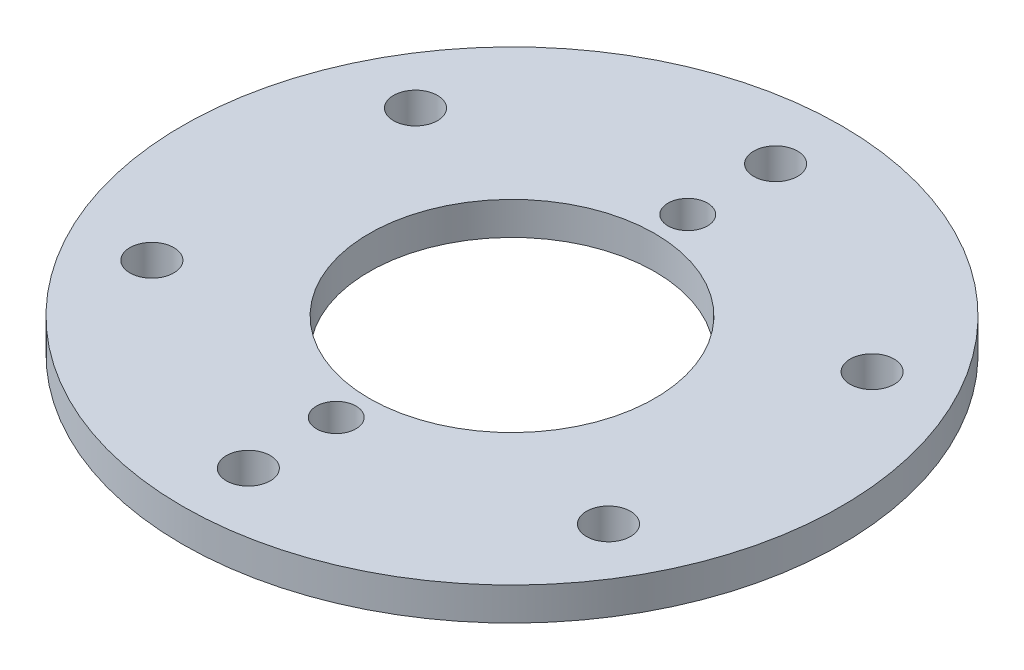
ISO-10303-21;
HEADER;
FILE_DESCRIPTION(('STEP AP214'),'2;1');
FILE_NAME('part.step','',(''),(''),'','','');
FILE_SCHEMA(('AUTOMOTIVE_DESIGN { 1 0 10303 214 1 1 1 1 }'));
ENDSEC;
DATA;
#1=APPLICATION_CONTEXT('core data for automotive mechanical design processes');
#2=APPLICATION_PROTOCOL_DEFINITION('international standard','automotive_design',2000,#1);
#3=PRODUCT_CONTEXT('',#1,'mechanical');
#4=PRODUCT('Part','Part','',(#3));
#5=PRODUCT_RELATED_PRODUCT_CATEGORY('part','',(#4));
#6=PRODUCT_DEFINITION_FORMATION('','',#4);
#7=PRODUCT_DEFINITION_CONTEXT('part definition',#1,'design');
#8=PRODUCT_DEFINITION('design','',#6,#7);
#9=PRODUCT_DEFINITION_SHAPE('','',#8);
#10=(LENGTH_UNIT() NAMED_UNIT(*) SI_UNIT(.MILLI.,.METRE.));
#11=(NAMED_UNIT(*) PLANE_ANGLE_UNIT() SI_UNIT($,.RADIAN.));
#12=(NAMED_UNIT(*) SI_UNIT($,.STERADIAN.) SOLID_ANGLE_UNIT());
#13=UNCERTAINTY_MEASURE_WITH_UNIT(LENGTH_MEASURE(1.E-05),#10,'distance_accuracy_value','');
#14=(GEOMETRIC_REPRESENTATION_CONTEXT(3) GLOBAL_UNCERTAINTY_ASSIGNED_CONTEXT((#13)) GLOBAL_UNIT_ASSIGNED_CONTEXT((#10,
#11,#12)) REPRESENTATION_CONTEXT('',''));
#15=CARTESIAN_POINT('',(0.,0.,0.));
#16=DIRECTION('',(0.,0.,1.));
#17=DIRECTION('',(1.,0.,0.));
#18=AXIS2_PLACEMENT_3D('',#15,#16,#17);
#19=CARTESIAN_POINT('',(0.,15.,0.));
#20=DIRECTION('',(0.,1.,0.));
#21=DIRECTION('',(0.,0.,1.));
#22=AXIS2_PLACEMENT_3D('',#19,#20,#21);
#23=PLANE('',#22);
#24=CARTESIAN_POINT('',(0.,15.,80.));
#25=DIRECTION('',(0.,1.,0.));
#26=DIRECTION('',(0.,0.,1.));
#27=AXIS2_PLACEMENT_3D('',#24,#25,#26);
#28=CIRCLE('',#27,9.);
#29=CARTESIAN_POINT('',(0.,15.,89.));
#30=VERTEX_POINT('',#29);
#31=EDGE_CURVE('E125',#30,#30,#28,.T.);
#32=ORIENTED_EDGE('',*,*,#31,.F.);
#33=EDGE_LOOP('',(#32));
#34=FACE_BOUND('',#33,.T.);
#35=CARTESIAN_POINT('',(0.,15.,-80.));
#36=DIRECTION('',(0.,1.,0.));
#37=DIRECTION('',(0.,0.,1.));
#38=AXIS2_PLACEMENT_3D('',#35,#36,#37);
#39=CIRCLE('',#38,9.);
#40=CARTESIAN_POINT('',(0.,15.,-71.));
#41=VERTEX_POINT('',#40);
#42=EDGE_CURVE('E117',#41,#41,#39,.T.);
#43=ORIENTED_EDGE('',*,*,#42,.F.);
#44=EDGE_LOOP('',(#43));
#45=FACE_BOUND('',#44,.T.);
#46=CARTESIAN_POINT('',(103.923048454132,15.,-60.0000000000012));
#47=DIRECTION('',(0.,1.,0.));
#48=DIRECTION('',(0.,0.,1.));
#49=AXIS2_PLACEMENT_3D('',#46,#47,#48);
#50=CIRCLE('',#49,9.99999999999999);
#51=CARTESIAN_POINT('',(103.923048454132,15.,-50.0000000000012));
#52=VERTEX_POINT('',#51);
#53=EDGE_CURVE('E109',#52,#52,#50,.T.);
#54=ORIENTED_EDGE('',*,*,#53,.F.);
#55=EDGE_LOOP('',(#54));
#56=FACE_BOUND('',#55,.T.);
#57=CARTESIAN_POINT('',(103.923048454133,15.,59.999999999999));
#58=DIRECTION('',(0.,1.,0.));
#59=DIRECTION('',(0.,0.,1.));
#60=AXIS2_PLACEMENT_3D('',#57,#58,#59);
#61=CIRCLE('',#60,9.99999999999999);
#62=CARTESIAN_POINT('',(103.923048454133,15.,69.999999999999));
#63=VERTEX_POINT('',#62);
#64=EDGE_CURVE('E101',#63,#63,#61,.T.);
#65=ORIENTED_EDGE('',*,*,#64,.F.);
#66=EDGE_LOOP('',(#65));
#67=FACE_BOUND('',#66,.T.);
#68=CARTESIAN_POINT('',(0.,15.,120.));
#69=DIRECTION('',(0.,1.,0.));
#70=DIRECTION('',(0.,0.,1.));
#71=AXIS2_PLACEMENT_3D('',#68,#69,#70);
#72=CIRCLE('',#71,10.);
#73=CARTESIAN_POINT('',(0.,15.,130.));
#74=VERTEX_POINT('',#73);
#75=EDGE_CURVE('E93',#74,#74,#72,.T.);
#76=ORIENTED_EDGE('',*,*,#75,.F.);
#77=EDGE_LOOP('',(#76));
#78=FACE_BOUND('',#77,.T.);
#79=CARTESIAN_POINT('',(-103.923048454132,15.,60.0000000000005));
#80=DIRECTION('',(0.,1.,0.));
#81=DIRECTION('',(0.,0.,1.));
#82=AXIS2_PLACEMENT_3D('',#79,#80,#81);
#83=CIRCLE('',#82,9.99999999999999);
#84=CARTESIAN_POINT('',(-103.923048454132,15.,70.0000000000005));
#85=VERTEX_POINT('',#84);
#86=EDGE_CURVE('E85',#85,#85,#83,.T.);
#87=ORIENTED_EDGE('',*,*,#86,.F.);
#88=EDGE_LOOP('',(#87));
#89=FACE_BOUND('',#88,.T.);
#90=CARTESIAN_POINT('',(-103.923048454133,15.,-59.9999999999998));
#91=DIRECTION('',(0.,1.,0.));
#92=DIRECTION('',(0.,0.,1.));
#93=AXIS2_PLACEMENT_3D('',#90,#91,#92);
#94=CIRCLE('',#93,9.99999999999999);
#95=CARTESIAN_POINT('',(-103.923048454133,15.,-49.9999999999998));
#96=VERTEX_POINT('',#95);
#97=EDGE_CURVE('E77',#96,#96,#94,.T.);
#98=ORIENTED_EDGE('',*,*,#97,.F.);
#99=EDGE_LOOP('',(#98));
#100=FACE_BOUND('',#99,.T.);
#101=CARTESIAN_POINT('',(0.,15.,-120.));
#102=DIRECTION('',(0.,1.,0.));
#103=DIRECTION('',(0.,0.,1.));
#104=AXIS2_PLACEMENT_3D('',#101,#102,#103);
#105=CIRCLE('',#104,10.);
#106=CARTESIAN_POINT('',(0.,15.,-110.));
#107=VERTEX_POINT('',#106);
#108=EDGE_CURVE('E69',#107,#107,#105,.T.);
#109=ORIENTED_EDGE('',*,*,#108,.F.);
#110=EDGE_LOOP('',(#109));
#111=FACE_BOUND('',#110,.T.);
#112=CARTESIAN_POINT('',(0.,15.,0.));
#113=DIRECTION('',(0.,1.,0.));
#114=DIRECTION('',(0.,0.,1.));
#115=AXIS2_PLACEMENT_3D('',#112,#113,#114);
#116=CIRCLE('',#115,150.);
#117=CARTESIAN_POINT('',(0.,15.,150.));
#118=VERTEX_POINT('',#117);
#119=EDGE_CURVE('E10',#118,#118,#116,.T.);
#120=ORIENTED_EDGE('',*,*,#119,.T.);
#121=EDGE_LOOP('',(#120));
#122=FACE_BOUND('',#121,.T.);
#123=CARTESIAN_POINT('',(0.,15.,0.));
#124=DIRECTION('',(0.,1.,0.));
#125=DIRECTION('',(0.,0.,1.));
#126=AXIS2_PLACEMENT_3D('',#123,#124,#125);
#127=CIRCLE('',#126,65.);
#128=CARTESIAN_POINT('',(0.,15.,65.));
#129=VERTEX_POINT('',#128);
#130=EDGE_CURVE('E56',#129,#129,#127,.T.);
#131=ORIENTED_EDGE('',*,*,#130,.F.);
#132=EDGE_LOOP('',(#131));
#133=FACE_BOUND('',#132,.T.);
#134=ADVANCED_FACE('F43',(#34,#45,#56,#67,#78,#89,#100,#111,#122,#133),#23,.T.);
#135=CARTESIAN_POINT('',(0.,0.,0.));
#136=DIRECTION('',(0.,1.,0.));
#137=DIRECTION('',(0.,0.,1.));
#138=AXIS2_PLACEMENT_3D('',#135,#136,#137);
#139=PLANE('',#138);
#140=CARTESIAN_POINT('',(0.,0.,80.));
#141=DIRECTION('',(0.,1.,0.));
#142=DIRECTION('',(0.,0.,1.));
#143=AXIS2_PLACEMENT_3D('',#140,#141,#142);
#144=CIRCLE('',#143,9.);
#145=CARTESIAN_POINT('',(0.,0.,89.));
#146=VERTEX_POINT('',#145);
#147=EDGE_CURVE('E121',#146,#146,#144,.T.);
#148=ORIENTED_EDGE('',*,*,#147,.T.);
#149=EDGE_LOOP('',(#148));
#150=FACE_BOUND('',#149,.T.);
#151=CARTESIAN_POINT('',(0.,0.,-80.));
#152=DIRECTION('',(0.,1.,0.));
#153=DIRECTION('',(0.,0.,1.));
#154=AXIS2_PLACEMENT_3D('',#151,#152,#153);
#155=CIRCLE('',#154,9.);
#156=CARTESIAN_POINT('',(0.,0.,-71.));
#157=VERTEX_POINT('',#156);
#158=EDGE_CURVE('E113',#157,#157,#155,.T.);
#159=ORIENTED_EDGE('',*,*,#158,.T.);
#160=EDGE_LOOP('',(#159));
#161=FACE_BOUND('',#160,.T.);
#162=CARTESIAN_POINT('',(103.923048454132,0.,-60.0000000000012));
#163=DIRECTION('',(0.,1.,0.));
#164=DIRECTION('',(0.,0.,1.));
#165=AXIS2_PLACEMENT_3D('',#162,#163,#164);
#166=CIRCLE('',#165,9.99999999999999);
#167=CARTESIAN_POINT('',(103.923048454132,0.,-50.0000000000012));
#168=VERTEX_POINT('',#167);
#169=EDGE_CURVE('E105',#168,#168,#166,.T.);
#170=ORIENTED_EDGE('',*,*,#169,.T.);
#171=EDGE_LOOP('',(#170));
#172=FACE_BOUND('',#171,.T.);
#173=CARTESIAN_POINT('',(103.923048454133,0.,59.999999999999));
#174=DIRECTION('',(0.,1.,0.));
#175=DIRECTION('',(0.,0.,1.));
#176=AXIS2_PLACEMENT_3D('',#173,#174,#175);
#177=CIRCLE('',#176,9.99999999999999);
#178=CARTESIAN_POINT('',(103.923048454133,0.,69.999999999999));
#179=VERTEX_POINT('',#178);
#180=EDGE_CURVE('E97',#179,#179,#177,.T.);
#181=ORIENTED_EDGE('',*,*,#180,.T.);
#182=EDGE_LOOP('',(#181));
#183=FACE_BOUND('',#182,.T.);
#184=CARTESIAN_POINT('',(0.,0.,120.));
#185=DIRECTION('',(0.,1.,0.));
#186=DIRECTION('',(0.,0.,1.));
#187=AXIS2_PLACEMENT_3D('',#184,#185,#186);
#188=CIRCLE('',#187,10.);
#189=CARTESIAN_POINT('',(0.,0.,130.));
#190=VERTEX_POINT('',#189);
#191=EDGE_CURVE('E89',#190,#190,#188,.T.);
#192=ORIENTED_EDGE('',*,*,#191,.T.);
#193=EDGE_LOOP('',(#192));
#194=FACE_BOUND('',#193,.T.);
#195=CARTESIAN_POINT('',(-103.923048454132,0.,60.0000000000005));
#196=DIRECTION('',(0.,1.,0.));
#197=DIRECTION('',(0.,0.,1.));
#198=AXIS2_PLACEMENT_3D('',#195,#196,#197);
#199=CIRCLE('',#198,9.99999999999999);
#200=CARTESIAN_POINT('',(-103.923048454132,0.,70.0000000000005));
#201=VERTEX_POINT('',#200);
#202=EDGE_CURVE('E81',#201,#201,#199,.T.);
#203=ORIENTED_EDGE('',*,*,#202,.T.);
#204=EDGE_LOOP('',(#203));
#205=FACE_BOUND('',#204,.T.);
#206=CARTESIAN_POINT('',(-103.923048454133,0.,-59.9999999999998));
#207=DIRECTION('',(0.,1.,0.));
#208=DIRECTION('',(0.,0.,1.));
#209=AXIS2_PLACEMENT_3D('',#206,#207,#208);
#210=CIRCLE('',#209,9.99999999999999);
#211=CARTESIAN_POINT('',(-103.923048454133,0.,-49.9999999999998));
#212=VERTEX_POINT('',#211);
#213=EDGE_CURVE('E73',#212,#212,#210,.T.);
#214=ORIENTED_EDGE('',*,*,#213,.T.);
#215=EDGE_LOOP('',(#214));
#216=FACE_BOUND('',#215,.T.);
#217=CARTESIAN_POINT('',(0.,0.,-120.));
#218=DIRECTION('',(0.,1.,0.));
#219=DIRECTION('',(0.,0.,1.));
#220=AXIS2_PLACEMENT_3D('',#217,#218,#219);
#221=CIRCLE('',#220,10.);
#222=CARTESIAN_POINT('',(0.,0.,-110.));
#223=VERTEX_POINT('',#222);
#224=EDGE_CURVE('E62',#223,#223,#221,.T.);
#225=ORIENTED_EDGE('',*,*,#224,.T.);
#226=EDGE_LOOP('',(#225));
#227=FACE_BOUND('',#226,.T.);
#228=CARTESIAN_POINT('',(0.,0.,0.));
#229=DIRECTION('',(0.,1.,0.));
#230=DIRECTION('',(0.,0.,1.));
#231=AXIS2_PLACEMENT_3D('',#228,#229,#230);
#232=CIRCLE('',#231,150.);
#233=CARTESIAN_POINT('',(0.,0.,150.));
#234=VERTEX_POINT('',#233);
#235=EDGE_CURVE('E47',#234,#234,#232,.T.);
#236=ORIENTED_EDGE('',*,*,#235,.F.);
#237=EDGE_LOOP('',(#236));
#238=FACE_BOUND('',#237,.T.);
#239=CARTESIAN_POINT('',(0.,0.,0.));
#240=DIRECTION('',(0.,1.,0.));
#241=DIRECTION('',(0.,0.,1.));
#242=AXIS2_PLACEMENT_3D('',#239,#240,#241);
#243=CIRCLE('',#242,65.);
#244=CARTESIAN_POINT('',(0.,0.,65.));
#245=VERTEX_POINT('',#244);
#246=EDGE_CURVE('E58',#245,#245,#243,.T.);
#247=ORIENTED_EDGE('',*,*,#246,.T.);
#248=EDGE_LOOP('',(#247));
#249=FACE_BOUND('',#248,.T.);
#250=ADVANCED_FACE('F134',(#150,#161,#172,#183,#194,#205,#216,#227,#238,#249),#139,.F.);
#251=CARTESIAN_POINT('',(0.,15.,0.));
#252=DIRECTION('',(0.,-1.,0.));
#253=DIRECTION('',(0.,0.,-1.));
#254=AXIS2_PLACEMENT_3D('',#251,#252,#253);
#255=CYLINDRICAL_SURFACE('',#254,150.);
#256=ORIENTED_EDGE('',*,*,#119,.F.);
#257=EDGE_LOOP('',(#256));
#258=FACE_BOUND('',#257,.T.);
#259=ORIENTED_EDGE('',*,*,#235,.T.);
#260=EDGE_LOOP('',(#259));
#261=FACE_BOUND('',#260,.T.);
#262=ADVANCED_FACE('F45',(#258,#261),#255,.T.);
#263=CARTESIAN_POINT('',(0.,15.,0.));
#264=DIRECTION('',(0.,-1.,0.));
#265=DIRECTION('',(0.,0.,-1.));
#266=AXIS2_PLACEMENT_3D('',#263,#264,#265);
#267=CYLINDRICAL_SURFACE('',#266,65.);
#268=ORIENTED_EDGE('',*,*,#130,.T.);
#269=EDGE_LOOP('',(#268));
#270=FACE_BOUND('',#269,.T.);
#271=ORIENTED_EDGE('',*,*,#246,.F.);
#272=EDGE_LOOP('',(#271));
#273=FACE_BOUND('',#272,.T.);
#274=ADVANCED_FACE('F152',(#270,#273),#267,.F.);
#275=CARTESIAN_POINT('',(0.,15.,-120.));
#276=DIRECTION('',(0.,1.,0.));
#277=DIRECTION('',(0.,0.,1.));
#278=AXIS2_PLACEMENT_3D('',#275,#276,#277);
#279=CYLINDRICAL_SURFACE('',#278,10.);
#280=ORIENTED_EDGE('',*,*,#224,.F.);
#281=EDGE_LOOP('',(#280));
#282=FACE_BOUND('',#281,.T.);
#283=ORIENTED_EDGE('',*,*,#108,.T.);
#284=EDGE_LOOP('',(#283));
#285=FACE_BOUND('',#284,.T.);
#286=ADVANCED_FACE('F155',(#282,#285),#279,.F.);
#287=CARTESIAN_POINT('',(-103.923048454133,15.,-59.9999999999998));
#288=DIRECTION('',(0.,1.,0.));
#289=DIRECTION('',(0.,0.,1.));
#290=AXIS2_PLACEMENT_3D('',#287,#288,#289);
#291=CYLINDRICAL_SURFACE('',#290,9.99999999999999);
#292=ORIENTED_EDGE('',*,*,#213,.F.);
#293=EDGE_LOOP('',(#292));
#294=FACE_BOUND('',#293,.T.);
#295=ORIENTED_EDGE('',*,*,#97,.T.);
#296=EDGE_LOOP('',(#295));
#297=FACE_BOUND('',#296,.T.);
#298=ADVANCED_FACE('F170',(#294,#297),#291,.F.);
#299=CARTESIAN_POINT('',(-103.923048454132,15.,60.0000000000005));
#300=DIRECTION('',(0.,1.,0.));
#301=DIRECTION('',(0.,0.,1.));
#302=AXIS2_PLACEMENT_3D('',#299,#300,#301);
#303=CYLINDRICAL_SURFACE('',#302,9.99999999999999);
#304=ORIENTED_EDGE('',*,*,#202,.F.);
#305=EDGE_LOOP('',(#304));
#306=FACE_BOUND('',#305,.T.);
#307=ORIENTED_EDGE('',*,*,#86,.T.);
#308=EDGE_LOOP('',(#307));
#309=FACE_BOUND('',#308,.T.);
#310=ADVANCED_FACE('F174',(#306,#309),#303,.F.);
#311=CARTESIAN_POINT('',(0.,15.,120.));
#312=DIRECTION('',(0.,1.,0.));
#313=DIRECTION('',(0.,0.,1.));
#314=AXIS2_PLACEMENT_3D('',#311,#312,#313);
#315=CYLINDRICAL_SURFACE('',#314,10.);
#316=ORIENTED_EDGE('',*,*,#191,.F.);
#317=EDGE_LOOP('',(#316));
#318=FACE_BOUND('',#317,.T.);
#319=ORIENTED_EDGE('',*,*,#75,.T.);
#320=EDGE_LOOP('',(#319));
#321=FACE_BOUND('',#320,.T.);
#322=ADVANCED_FACE('F178',(#318,#321),#315,.F.);
#323=CARTESIAN_POINT('',(103.923048454133,15.,59.999999999999));
#324=DIRECTION('',(0.,1.,0.));
#325=DIRECTION('',(0.,0.,1.));
#326=AXIS2_PLACEMENT_3D('',#323,#324,#325);
#327=CYLINDRICAL_SURFACE('',#326,9.99999999999999);
#328=ORIENTED_EDGE('',*,*,#180,.F.);
#329=EDGE_LOOP('',(#328));
#330=FACE_BOUND('',#329,.T.);
#331=ORIENTED_EDGE('',*,*,#64,.T.);
#332=EDGE_LOOP('',(#331));
#333=FACE_BOUND('',#332,.T.);
#334=ADVANCED_FACE('F182',(#330,#333),#327,.F.);
#335=CARTESIAN_POINT('',(103.923048454132,15.,-60.0000000000012));
#336=DIRECTION('',(0.,1.,0.));
#337=DIRECTION('',(0.,0.,1.));
#338=AXIS2_PLACEMENT_3D('',#335,#336,#337);
#339=CYLINDRICAL_SURFACE('',#338,9.99999999999999);
#340=ORIENTED_EDGE('',*,*,#169,.F.);
#341=EDGE_LOOP('',(#340));
#342=FACE_BOUND('',#341,.T.);
#343=ORIENTED_EDGE('',*,*,#53,.T.);
#344=EDGE_LOOP('',(#343));
#345=FACE_BOUND('',#344,.T.);
#346=ADVANCED_FACE('F186',(#342,#345),#339,.F.);
#347=CARTESIAN_POINT('',(0.,15.,-80.));
#348=DIRECTION('',(0.,1.,0.));
#349=DIRECTION('',(0.,0.,1.));
#350=AXIS2_PLACEMENT_3D('',#347,#348,#349);
#351=CYLINDRICAL_SURFACE('',#350,9.);
#352=ORIENTED_EDGE('',*,*,#158,.F.);
#353=EDGE_LOOP('',(#352));
#354=FACE_BOUND('',#353,.T.);
#355=ORIENTED_EDGE('',*,*,#42,.T.);
#356=EDGE_LOOP('',(#355));
#357=FACE_BOUND('',#356,.T.);
#358=ADVANCED_FACE('F190',(#354,#357),#351,.F.);
#359=CARTESIAN_POINT('',(0.,15.,80.));
#360=DIRECTION('',(0.,1.,0.));
#361=DIRECTION('',(0.,0.,1.));
#362=AXIS2_PLACEMENT_3D('',#359,#360,#361);
#363=CYLINDRICAL_SURFACE('',#362,9.);
#364=ORIENTED_EDGE('',*,*,#147,.F.);
#365=EDGE_LOOP('',(#364));
#366=FACE_BOUND('',#365,.T.);
#367=ORIENTED_EDGE('',*,*,#31,.T.);
#368=EDGE_LOOP('',(#367));
#369=FACE_BOUND('',#368,.T.);
#370=ADVANCED_FACE('F130',(#366,#369),#363,.F.);
#371=CLOSED_SHELL('',(#134,#250,#262,#274,#286,#298,#310,#322,#334,#346,#358,#370));
#372=MANIFOLD_SOLID_BREP('B2',#371);
#373=ADVANCED_BREP_SHAPE_REPRESENTATION('',(#18,#372),#14);
#374=SHAPE_DEFINITION_REPRESENTATION(#9,#373);
ENDSEC;
END-ISO-10303-21;
